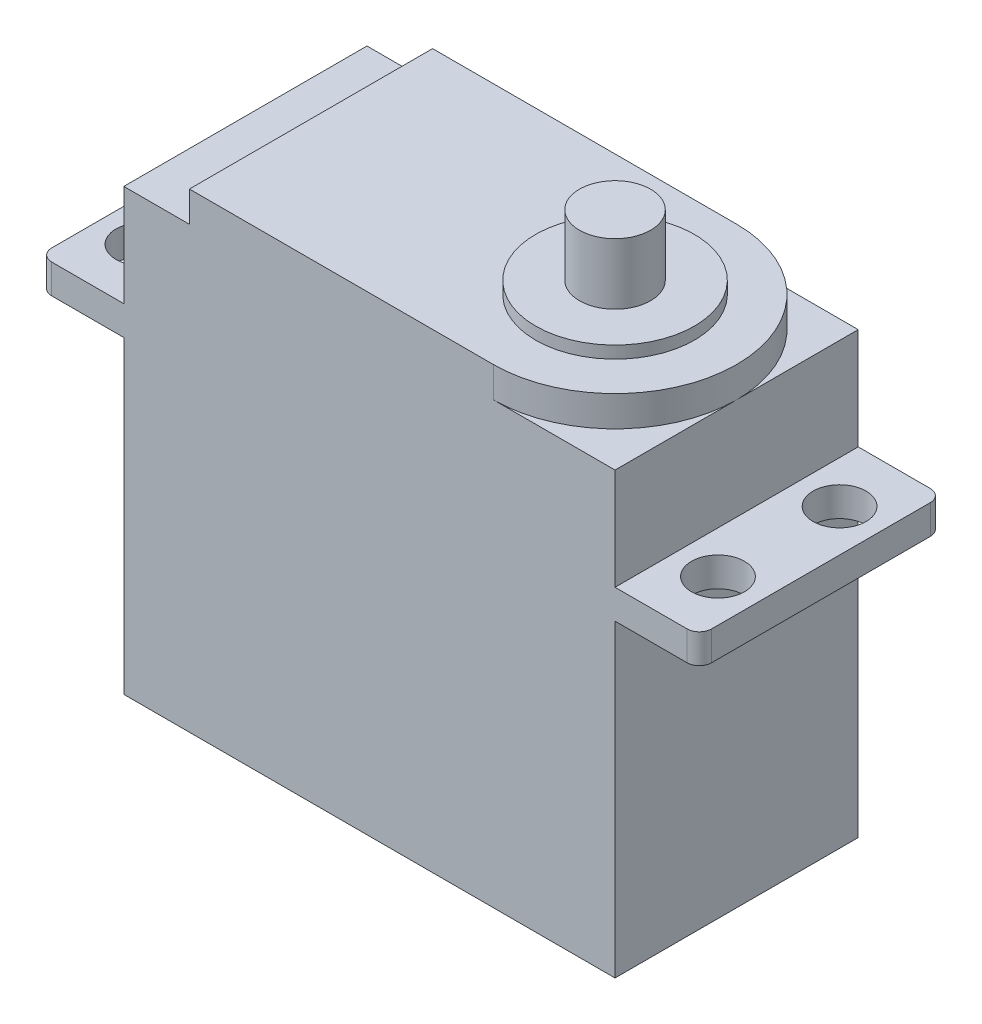
ISO-10303-21;
HEADER;
FILE_DESCRIPTION(('STEP AP214'),'2;1');
FILE_NAME('part.step','',(''),(''),'','','');
FILE_SCHEMA(('AUTOMOTIVE_DESIGN { 1 0 10303 214 1 1 1 1 }'));
ENDSEC;
DATA;
#1=APPLICATION_CONTEXT('core data for automotive mechanical design processes');
#2=APPLICATION_PROTOCOL_DEFINITION('international standard','automotive_design',2000,#1);
#3=PRODUCT_CONTEXT('',#1,'mechanical');
#4=PRODUCT('Part','Part','',(#3));
#5=PRODUCT_RELATED_PRODUCT_CATEGORY('part','',(#4));
#6=PRODUCT_DEFINITION_FORMATION('','',#4);
#7=PRODUCT_DEFINITION_CONTEXT('part definition',#1,'design');
#8=PRODUCT_DEFINITION('design','',#6,#7);
#9=PRODUCT_DEFINITION_SHAPE('','',#8);
#10=(LENGTH_UNIT() NAMED_UNIT(*) SI_UNIT(.MILLI.,.METRE.));
#11=(NAMED_UNIT(*) PLANE_ANGLE_UNIT() SI_UNIT($,.RADIAN.));
#12=(NAMED_UNIT(*) SI_UNIT($,.STERADIAN.) SOLID_ANGLE_UNIT());
#13=UNCERTAINTY_MEASURE_WITH_UNIT(LENGTH_MEASURE(1.E-05),#10,'distance_accuracy_value','');
#14=(GEOMETRIC_REPRESENTATION_CONTEXT(3) GLOBAL_UNCERTAINTY_ASSIGNED_CONTEXT((#13)) GLOBAL_UNIT_ASSIGNED_CONTEXT((#10,
#11,#12)) REPRESENTATION_CONTEXT('',''));
#15=CARTESIAN_POINT('',(0.,0.,0.));
#16=DIRECTION('',(0.,0.,1.));
#17=DIRECTION('',(1.,0.,0.));
#18=AXIS2_PLACEMENT_3D('',#15,#16,#17);
#19=CARTESIAN_POINT('',(0.,36.,0.));
#20=DIRECTION('',(0.,1.,0.));
#21=DIRECTION('',(0.,0.,1.));
#22=AXIS2_PLACEMENT_3D('',#19,#20,#21);
#23=PLANE('',#22);
#24=DIRECTION('',(0.,0.,1.));
#25=VECTOR('',#24,1.);
#26=CARTESIAN_POINT('',(-14.73,36.,0.));
#27=LINE('',#26,#25);
#28=CARTESIAN_POINT('',(-14.73,36.,-9.95));
#29=VERTEX_POINT('',#28);
#30=CARTESIAN_POINT('',(-14.73,36.,9.95));
#31=VERTEX_POINT('',#30);
#32=EDGE_CURVE('E194',#29,#31,#27,.T.);
#33=ORIENTED_EDGE('',*,*,#32,.F.);
#34=DIRECTION('',(-1.,0.,0.));
#35=VECTOR('',#34,1.);
#36=CARTESIAN_POINT('',(-20.1,36.,-9.95));
#37=LINE('',#36,#35);
#38=CARTESIAN_POINT('',(-20.1,36.,-9.95));
#39=VERTEX_POINT('',#38);
#40=EDGE_CURVE('E265',#29,#39,#37,.T.);
#41=ORIENTED_EDGE('',*,*,#40,.T.);
#42=DIRECTION('',(0.,0.,1.));
#43=VECTOR('',#42,1.);
#44=CARTESIAN_POINT('',(-20.1,36.,-9.95));
#45=LINE('',#44,#43);
#46=CARTESIAN_POINT('',(-20.1,36.,9.95));
#47=VERTEX_POINT('',#46);
#48=EDGE_CURVE('E269',#39,#47,#45,.T.);
#49=ORIENTED_EDGE('',*,*,#48,.T.);
#50=DIRECTION('',(1.,0.,0.));
#51=VECTOR('',#50,1.);
#52=CARTESIAN_POINT('',(-20.1,36.,9.95));
#53=LINE('',#52,#51);
#54=EDGE_CURVE('E271',#47,#31,#53,.T.);
#55=ORIENTED_EDGE('',*,*,#54,.T.);
#56=EDGE_LOOP('',(#33,#41,#49,#55));
#57=FACE_BOUND('',#56,.T.);
#58=ADVANCED_FACE('F34',(#57),#23,.T.);
#59=CARTESIAN_POINT('',(10.15,36.,0.));
#60=DIRECTION('',(0.,1.,0.));
#61=DIRECTION('',(0.,0.,1.));
#62=AXIS2_PLACEMENT_3D('',#59,#60,#61);
#63=CIRCLE('',#62,9.95);
#64=CARTESIAN_POINT('',(10.15,36.,9.95));
#65=VERTEX_POINT('',#64);
#66=CARTESIAN_POINT('',(20.1,36.,0.));
#67=VERTEX_POINT('',#66);
#68=EDGE_CURVE('E392',#65,#67,#63,.T.);
#69=ORIENTED_EDGE('',*,*,#68,.F.);
#70=CARTESIAN_POINT('',(20.1,36.,9.95));
#71=VERTEX_POINT('',#70);
#72=EDGE_CURVE('E200',#65,#71,#53,.T.);
#73=ORIENTED_EDGE('',*,*,#72,.T.);
#74=DIRECTION('',(0.,0.,-1.));
#75=VECTOR('',#74,1.);
#76=CARTESIAN_POINT('',(20.1,36.,-9.95));
#77=LINE('',#76,#75);
#78=EDGE_CURVE('E262',#71,#67,#77,.T.);
#79=ORIENTED_EDGE('',*,*,#78,.T.);
#80=EDGE_LOOP('',(#69,#73,#79));
#81=FACE_BOUND('',#80,.T.);
#82=ADVANCED_FACE('F391',(#81),#23,.T.);
#83=CARTESIAN_POINT('',(20.1,36.,-9.95));
#84=DIRECTION('',(-1.,0.,0.));
#85=DIRECTION('',(0.,0.,1.));
#86=AXIS2_PLACEMENT_3D('',#83,#84,#85);
#87=PLANE('',#86);
#88=DIRECTION('',(0.,0.,1.));
#89=VECTOR('',#88,1.);
#90=CARTESIAN_POINT('',(20.1,27.69,-9.95));
#91=LINE('',#90,#89);
#92=CARTESIAN_POINT('',(20.1,27.69,-9.95));
#93=VERTEX_POINT('',#92);
#94=CARTESIAN_POINT('',(20.1,27.69,9.95));
#95=VERTEX_POINT('',#94);
#96=EDGE_CURVE('E258',#93,#95,#91,.T.);
#97=ORIENTED_EDGE('',*,*,#96,.F.);
#98=DIRECTION('',(0.,-1.,0.));
#99=VECTOR('',#98,1.);
#100=CARTESIAN_POINT('',(20.1,36.,-9.95));
#101=LINE('',#100,#99);
#102=CARTESIAN_POINT('',(20.1,36.,-9.95));
#103=VERTEX_POINT('',#102);
#104=EDGE_CURVE('E296',#103,#93,#101,.T.);
#105=ORIENTED_EDGE('',*,*,#104,.F.);
#106=EDGE_CURVE('E266',#67,#103,#77,.T.);
#107=ORIENTED_EDGE('',*,*,#106,.F.);
#108=ORIENTED_EDGE('',*,*,#78,.F.);
#109=DIRECTION('',(0.,-1.,0.));
#110=VECTOR('',#109,1.);
#111=CARTESIAN_POINT('',(20.1,36.,9.95));
#112=LINE('',#111,#110);
#113=EDGE_CURVE('E285',#71,#95,#112,.T.);
#114=ORIENTED_EDGE('',*,*,#113,.T.);
#115=EDGE_LOOP('',(#97,#105,#107,#108,#114));
#116=FACE_BOUND('',#115,.T.);
#117=ADVANCED_FACE('F387',(#116),#87,.F.);
#118=DIRECTION('',(0.,0.,-1.));
#119=VECTOR('',#118,1.);
#120=CARTESIAN_POINT('',(20.1,25.29,-9.95));
#121=LINE('',#120,#119);
#122=CARTESIAN_POINT('',(20.1,25.29,9.95));
#123=VERTEX_POINT('',#122);
#124=CARTESIAN_POINT('',(20.1,25.29,-9.95));
#125=VERTEX_POINT('',#124);
#126=EDGE_CURVE('E252',#123,#125,#121,.T.);
#127=ORIENTED_EDGE('',*,*,#126,.F.);
#128=CARTESIAN_POINT('',(20.1,0.,9.95));
#129=VERTEX_POINT('',#128);
#130=EDGE_CURVE('E273',#123,#129,#112,.T.);
#131=ORIENTED_EDGE('',*,*,#130,.T.);
#132=DIRECTION('',(0.,0.,-1.));
#133=VECTOR('',#132,1.);
#134=CARTESIAN_POINT('',(20.1,0.,-9.95));
#135=LINE('',#134,#133);
#136=CARTESIAN_POINT('',(20.1,0.,-9.95));
#137=VERTEX_POINT('',#136);
#138=EDGE_CURVE('E261',#129,#137,#135,.T.);
#139=ORIENTED_EDGE('',*,*,#138,.T.);
#140=EDGE_CURVE('E295',#125,#137,#101,.T.);
#141=ORIENTED_EDGE('',*,*,#140,.F.);
#142=EDGE_LOOP('',(#127,#131,#139,#141));
#143=FACE_BOUND('',#142,.T.);
#144=ADVANCED_FACE('F367',(#143),#87,.F.);
#145=CARTESIAN_POINT('',(-20.1,36.,-9.95));
#146=DIRECTION('',(1.,0.,0.));
#147=DIRECTION('',(0.,0.,-1.));
#148=AXIS2_PLACEMENT_3D('',#145,#146,#147);
#149=PLANE('',#148);
#150=DIRECTION('',(0.,0.,-1.));
#151=VECTOR('',#150,1.);
#152=CARTESIAN_POINT('',(-20.1,27.69,-9.95));
#153=LINE('',#152,#151);
#154=CARTESIAN_POINT('',(-20.1,27.69,9.95));
#155=VERTEX_POINT('',#154);
#156=CARTESIAN_POINT('',(-20.1,27.69,-9.95));
#157=VERTEX_POINT('',#156);
#158=EDGE_CURVE('E255',#155,#157,#153,.T.);
#159=ORIENTED_EDGE('',*,*,#158,.F.);
#160=DIRECTION('',(0.,-1.,0.));
#161=VECTOR('',#160,1.);
#162=CARTESIAN_POINT('',(-20.1,36.,9.95));
#163=LINE('',#162,#161);
#164=EDGE_CURVE('E289',#47,#155,#163,.T.);
#165=ORIENTED_EDGE('',*,*,#164,.F.);
#166=ORIENTED_EDGE('',*,*,#48,.F.);
#167=DIRECTION('',(0.,-1.,0.));
#168=VECTOR('',#167,1.);
#169=CARTESIAN_POINT('',(-20.1,36.,-9.95));
#170=LINE('',#169,#168);
#171=EDGE_CURVE('E293',#39,#157,#170,.T.);
#172=ORIENTED_EDGE('',*,*,#171,.T.);
#173=EDGE_LOOP('',(#159,#165,#166,#172));
#174=FACE_BOUND('',#173,.T.);
#175=ADVANCED_FACE('F457',(#174),#149,.F.);
#176=DIRECTION('',(0.,0.,1.));
#177=VECTOR('',#176,1.);
#178=CARTESIAN_POINT('',(-20.1,25.29,-9.95));
#179=LINE('',#178,#177);
#180=CARTESIAN_POINT('',(-20.1,25.29,-9.95));
#181=VERTEX_POINT('',#180);
#182=CARTESIAN_POINT('',(-20.1,25.29,9.95));
#183=VERTEX_POINT('',#182);
#184=EDGE_CURVE('E249',#181,#183,#179,.T.);
#185=ORIENTED_EDGE('',*,*,#184,.F.);
#186=CARTESIAN_POINT('',(-20.1,0.,-9.95));
#187=VERTEX_POINT('',#186);
#188=EDGE_CURVE('E292',#181,#187,#170,.T.);
#189=ORIENTED_EDGE('',*,*,#188,.T.);
#190=DIRECTION('',(0.,0.,1.));
#191=VECTOR('',#190,1.);
#192=CARTESIAN_POINT('',(-20.1,0.,-9.95));
#193=LINE('',#192,#191);
#194=CARTESIAN_POINT('',(-20.1,0.,9.95));
#195=VERTEX_POINT('',#194);
#196=EDGE_CURVE('E279',#187,#195,#193,.T.);
#197=ORIENTED_EDGE('',*,*,#196,.T.);
#198=EDGE_CURVE('E288',#183,#195,#163,.T.);
#199=ORIENTED_EDGE('',*,*,#198,.F.);
#200=EDGE_LOOP('',(#185,#189,#197,#199));
#201=FACE_BOUND('',#200,.T.);
#202=ADVANCED_FACE('F351',(#201),#149,.F.);
#203=CARTESIAN_POINT('',(-20.1,36.,-9.95));
#204=DIRECTION('',(0.,0.,1.));
#205=DIRECTION('',(1.,0.,0.));
#206=AXIS2_PLACEMENT_3D('',#203,#204,#205);
#207=PLANE('',#206);
#208=DIRECTION('',(-1.,0.,0.));
#209=VECTOR('',#208,1.);
#210=CARTESIAN_POINT('',(27.,27.69,-9.95));
#211=LINE('',#210,#209);
#212=CARTESIAN_POINT('',(26.,27.69,-9.95));
#213=VERTEX_POINT('',#212);
#214=EDGE_CURVE('E247',#213,#93,#211,.T.);
#215=ORIENTED_EDGE('',*,*,#214,.F.);
#216=DIRECTION('',(0.,1.,0.));
#217=VECTOR('',#216,1.);
#218=CARTESIAN_POINT('',(26.,36.,-9.95));
#219=LINE('',#218,#217);
#220=CARTESIAN_POINT('',(26.,25.29,-9.95));
#221=VERTEX_POINT('',#220);
#222=EDGE_CURVE('E327',#213,#221,#219,.F.);
#223=ORIENTED_EDGE('',*,*,#222,.T.);
#224=DIRECTION('',(-1.,0.,0.));
#225=VECTOR('',#224,1.);
#226=CARTESIAN_POINT('',(27.,25.29,-9.95));
#227=LINE('',#226,#225);
#228=EDGE_CURVE('E238',#221,#125,#227,.T.);
#229=ORIENTED_EDGE('',*,*,#228,.T.);
#230=ORIENTED_EDGE('',*,*,#140,.T.);
#231=DIRECTION('',(-1.,0.,0.));
#232=VECTOR('',#231,1.);
#233=CARTESIAN_POINT('',(-20.1,0.,-9.95));
#234=LINE('',#233,#232);
#235=EDGE_CURVE('E276',#137,#187,#234,.T.);
#236=ORIENTED_EDGE('',*,*,#235,.T.);
#237=ORIENTED_EDGE('',*,*,#188,.F.);
#238=CARTESIAN_POINT('',(-26.,25.29,-9.95));
#239=VERTEX_POINT('',#238);
#240=EDGE_CURVE('E234',#181,#239,#227,.T.);
#241=ORIENTED_EDGE('',*,*,#240,.T.);
#242=DIRECTION('',(0.,1.,0.));
#243=VECTOR('',#242,1.);
#244=CARTESIAN_POINT('',(-26.,27.69,-9.95));
#245=LINE('',#244,#243);
#246=CARTESIAN_POINT('',(-26.,27.69,-9.95));
#247=VERTEX_POINT('',#246);
#248=EDGE_CURVE('E324',#239,#247,#245,.T.);
#249=ORIENTED_EDGE('',*,*,#248,.T.);
#250=EDGE_CURVE('E246',#157,#247,#211,.T.);
#251=ORIENTED_EDGE('',*,*,#250,.F.);
#252=ORIENTED_EDGE('',*,*,#171,.F.);
#253=ORIENTED_EDGE('',*,*,#40,.F.);
#254=DIRECTION('',(0.,-1.,0.));
#255=VECTOR('',#254,1.);
#256=CARTESIAN_POINT('',(-14.73,38.5,-9.95));
#257=LINE('',#256,#255);
#258=CARTESIAN_POINT('',(-14.73,38.5,-9.95));
#259=VERTEX_POINT('',#258);
#260=EDGE_CURVE('E206',#259,#29,#257,.T.);
#261=ORIENTED_EDGE('',*,*,#260,.F.);
#262=DIRECTION('',(-1.,0.,0.));
#263=VECTOR('',#262,1.);
#264=CARTESIAN_POINT('',(0.,38.5,-9.95));
#265=LINE('',#264,#263);
#266=CARTESIAN_POINT('',(10.15,38.5,-9.95));
#267=VERTEX_POINT('',#266);
#268=EDGE_CURVE('E184',#267,#259,#265,.T.);
#269=ORIENTED_EDGE('',*,*,#268,.F.);
#270=DIRECTION('',(0.,-1.,0.));
#271=VECTOR('',#270,1.);
#272=CARTESIAN_POINT('',(10.15,38.5,-9.95));
#273=LINE('',#272,#271);
#274=CARTESIAN_POINT('',(10.15,36.,-9.95));
#275=VERTEX_POINT('',#274);
#276=EDGE_CURVE('E181',#267,#275,#273,.T.);
#277=ORIENTED_EDGE('',*,*,#276,.T.);
#278=EDGE_CURVE('E267',#103,#275,#37,.T.);
#279=ORIENTED_EDGE('',*,*,#278,.F.);
#280=ORIENTED_EDGE('',*,*,#104,.T.);
#281=EDGE_LOOP('',(#215,#223,#229,#230,#236,#237,#241,#249,#251,#252,#253,#261,#269,#277,#279,#280));
#282=FACE_BOUND('',#281,.T.);
#283=ADVANCED_FACE('F354',(#282),#207,.F.);
#284=CARTESIAN_POINT('',(-20.1,36.,9.95));
#285=DIRECTION('',(0.,0.,-1.));
#286=DIRECTION('',(-1.,0.,0.));
#287=AXIS2_PLACEMENT_3D('',#284,#285,#286);
#288=PLANE('',#287);
#289=DIRECTION('',(-1.,0.,0.));
#290=VECTOR('',#289,1.);
#291=CARTESIAN_POINT('',(27.,25.29,9.95));
#292=LINE('',#291,#290);
#293=CARTESIAN_POINT('',(26.,25.29,9.95));
#294=VERTEX_POINT('',#293);
#295=EDGE_CURVE('E241',#294,#123,#292,.T.);
#296=ORIENTED_EDGE('',*,*,#295,.F.);
#297=DIRECTION('',(0.,-1.,0.));
#298=VECTOR('',#297,1.);
#299=CARTESIAN_POINT('',(26.,36.,9.95));
#300=LINE('',#299,#298);
#301=CARTESIAN_POINT('',(26.,27.69,9.95));
#302=VERTEX_POINT('',#301);
#303=EDGE_CURVE('E318',#294,#302,#300,.F.);
#304=ORIENTED_EDGE('',*,*,#303,.T.);
#305=DIRECTION('',(-1.,0.,0.));
#306=VECTOR('',#305,1.);
#307=CARTESIAN_POINT('',(27.,27.69,9.95));
#308=LINE('',#307,#306);
#309=EDGE_CURVE('E244',#302,#95,#308,.T.);
#310=ORIENTED_EDGE('',*,*,#309,.T.);
#311=ORIENTED_EDGE('',*,*,#113,.F.);
#312=ORIENTED_EDGE('',*,*,#72,.F.);
#313=DIRECTION('',(0.,-1.,0.));
#314=VECTOR('',#313,1.);
#315=CARTESIAN_POINT('',(10.15,38.5,9.95));
#316=LINE('',#315,#314);
#317=CARTESIAN_POINT('',(10.15,38.5,9.95));
#318=VERTEX_POINT('',#317);
#319=EDGE_CURVE('E178',#318,#65,#316,.T.);
#320=ORIENTED_EDGE('',*,*,#319,.F.);
#321=DIRECTION('',(1.,0.,0.));
#322=VECTOR('',#321,1.);
#323=CARTESIAN_POINT('',(0.,38.5,9.95));
#324=LINE('',#323,#322);
#325=CARTESIAN_POINT('',(-14.73,38.5,9.95));
#326=VERTEX_POINT('',#325);
#327=EDGE_CURVE('E185',#326,#318,#324,.T.);
#328=ORIENTED_EDGE('',*,*,#327,.F.);
#329=DIRECTION('',(0.,-1.,0.));
#330=VECTOR('',#329,1.);
#331=CARTESIAN_POINT('',(-14.73,38.5,9.95));
#332=LINE('',#331,#330);
#333=EDGE_CURVE('E410',#326,#31,#332,.T.);
#334=ORIENTED_EDGE('',*,*,#333,.T.);
#335=ORIENTED_EDGE('',*,*,#54,.F.);
#336=ORIENTED_EDGE('',*,*,#164,.T.);
#337=CARTESIAN_POINT('',(-26.,27.69,9.95));
#338=VERTEX_POINT('',#337);
#339=EDGE_CURVE('E243',#155,#338,#308,.T.);
#340=ORIENTED_EDGE('',*,*,#339,.T.);
#341=DIRECTION('',(0.,-1.,0.));
#342=VECTOR('',#341,1.);
#343=CARTESIAN_POINT('',(-26.,25.29,9.95));
#344=LINE('',#343,#342);
#345=CARTESIAN_POINT('',(-26.,25.29,9.95));
#346=VERTEX_POINT('',#345);
#347=EDGE_CURVE('E315',#338,#346,#344,.T.);
#348=ORIENTED_EDGE('',*,*,#347,.T.);
#349=EDGE_CURVE('E240',#183,#346,#292,.T.);
#350=ORIENTED_EDGE('',*,*,#349,.F.);
#351=ORIENTED_EDGE('',*,*,#198,.T.);
#352=DIRECTION('',(1.,0.,0.));
#353=VECTOR('',#352,1.);
#354=CARTESIAN_POINT('',(-20.1,0.,9.95));
#355=LINE('',#354,#353);
#356=EDGE_CURVE('E282',#195,#129,#355,.T.);
#357=ORIENTED_EDGE('',*,*,#356,.T.);
#358=ORIENTED_EDGE('',*,*,#130,.F.);
#359=EDGE_LOOP('',(#296,#304,#310,#311,#312,#320,#328,#334,#335,#336,#340,#348,#350,#351,#357,#358));
#360=FACE_BOUND('',#359,.T.);
#361=ADVANCED_FACE('F198',(#360),#288,.F.);
#362=EDGE_CURVE('E299',#67,#275,#63,.T.);
#363=ORIENTED_EDGE('',*,*,#362,.F.);
#364=ORIENTED_EDGE('',*,*,#106,.T.);
#365=ORIENTED_EDGE('',*,*,#278,.T.);
#366=EDGE_LOOP('',(#363,#364,#365));
#367=FACE_BOUND('',#366,.T.);
#368=ADVANCED_FACE('F437',(#367),#23,.T.);
#369=CARTESIAN_POINT('',(0.,0.,0.));
#370=DIRECTION('',(0.,1.,0.));
#371=DIRECTION('',(0.,0.,1.));
#372=AXIS2_PLACEMENT_3D('',#369,#370,#371);
#373=PLANE('',#372);
#374=ORIENTED_EDGE('',*,*,#138,.F.);
#375=ORIENTED_EDGE('',*,*,#356,.F.);
#376=ORIENTED_EDGE('',*,*,#196,.F.);
#377=ORIENTED_EDGE('',*,*,#235,.F.);
#378=EDGE_LOOP('',(#374,#375,#376,#377));
#379=FACE_BOUND('',#378,.T.);
#380=ADVANCED_FACE('F362',(#379),#373,.F.);
#381=CARTESIAN_POINT('',(-27.,0.,0.));
#382=DIRECTION('',(-1.,0.,0.));
#383=DIRECTION('',(0.,0.,1.));
#384=AXIS2_PLACEMENT_3D('',#381,#382,#383);
#385=PLANE('',#384);
#386=DIRECTION('',(0.,0.,1.));
#387=VECTOR('',#386,1.);
#388=CARTESIAN_POINT('',(-27.,27.69,9.95));
#389=LINE('',#388,#387);
#390=CARTESIAN_POINT('',(-27.,27.69,-8.95));
#391=VERTEX_POINT('',#390);
#392=CARTESIAN_POINT('',(-27.,27.69,8.95));
#393=VERTEX_POINT('',#392);
#394=EDGE_CURVE('E226',#391,#393,#389,.T.);
#395=ORIENTED_EDGE('',*,*,#394,.F.);
#396=DIRECTION('',(0.,1.,0.));
#397=VECTOR('',#396,1.);
#398=CARTESIAN_POINT('',(-27.,25.29,-8.95));
#399=LINE('',#398,#397);
#400=CARTESIAN_POINT('',(-27.,25.29,-8.95));
#401=VERTEX_POINT('',#400);
#402=EDGE_CURVE('E49',#391,#401,#399,.F.);
#403=ORIENTED_EDGE('',*,*,#402,.T.);
#404=DIRECTION('',(0.,0.,-1.));
#405=VECTOR('',#404,1.);
#406=CARTESIAN_POINT('',(-27.,25.29,-9.95));
#407=LINE('',#406,#405);
#408=CARTESIAN_POINT('',(-27.,25.29,8.95));
#409=VERTEX_POINT('',#408);
#410=EDGE_CURVE('E231',#409,#401,#407,.T.);
#411=ORIENTED_EDGE('',*,*,#410,.F.);
#412=DIRECTION('',(0.,-1.,0.));
#413=VECTOR('',#412,1.);
#414=CARTESIAN_POINT('',(-27.,27.69,8.95));
#415=LINE('',#414,#413);
#416=EDGE_CURVE('E333',#409,#393,#415,.F.);
#417=ORIENTED_EDGE('',*,*,#416,.T.);
#418=EDGE_LOOP('',(#395,#403,#411,#417));
#419=FACE_BOUND('',#418,.T.);
#420=ADVANCED_FACE('F336',(#419),#385,.T.);
#421=CARTESIAN_POINT('',(27.,25.29,-9.95));
#422=DIRECTION('',(0.,1.,0.));
#423=DIRECTION('',(0.,0.,1.));
#424=AXIS2_PLACEMENT_3D('',#421,#422,#423);
#425=PLANE('',#424);
#426=CARTESIAN_POINT('',(-23.55,25.29,4.975));
#427=DIRECTION('',(0.,1.,0.));
#428=DIRECTION('',(0.,0.,1.));
#429=AXIS2_PLACEMENT_3D('',#426,#427,#428);
#430=CIRCLE('',#429,2.165);
#431=CARTESIAN_POINT('',(-23.55,25.29,7.14));
#432=VERTEX_POINT('',#431);
#433=EDGE_CURVE('E222',#432,#432,#430,.T.);
#434=ORIENTED_EDGE('',*,*,#433,.T.);
#435=EDGE_LOOP('',(#434));
#436=FACE_BOUND('',#435,.T.);
#437=CARTESIAN_POINT('',(-23.55,25.29,-4.97499999999999));
#438=DIRECTION('',(0.,1.,0.));
#439=DIRECTION('',(0.,0.,1.));
#440=AXIS2_PLACEMENT_3D('',#437,#438,#439);
#441=CIRCLE('',#440,2.165);
#442=CARTESIAN_POINT('',(-23.55,25.29,-2.80999999999999));
#443=VERTEX_POINT('',#442);
#444=EDGE_CURVE('E219',#443,#443,#441,.T.);
#445=ORIENTED_EDGE('',*,*,#444,.T.);
#446=EDGE_LOOP('',(#445));
#447=FACE_BOUND('',#446,.T.);
#448=ORIENTED_EDGE('',*,*,#410,.T.);
#449=CARTESIAN_POINT('',(-26.,25.29,-8.95));
#450=DIRECTION('',(0.,1.,0.));
#451=DIRECTION('',(0.,0.,1.));
#452=AXIS2_PLACEMENT_3D('',#449,#450,#451);
#453=CIRCLE('',#452,1.);
#454=EDGE_CURVE('E11',#401,#239,#453,.F.);
#455=ORIENTED_EDGE('',*,*,#454,.T.);
#456=ORIENTED_EDGE('',*,*,#240,.F.);
#457=ORIENTED_EDGE('',*,*,#184,.T.);
#458=ORIENTED_EDGE('',*,*,#349,.T.);
#459=CARTESIAN_POINT('',(-26.,25.29,8.95));
#460=DIRECTION('',(0.,1.,0.));
#461=DIRECTION('',(0.,0.,1.));
#462=AXIS2_PLACEMENT_3D('',#459,#460,#461);
#463=CIRCLE('',#462,1.);
#464=EDGE_CURVE('E42',#346,#409,#463,.F.);
#465=ORIENTED_EDGE('',*,*,#464,.T.);
#466=EDGE_LOOP('',(#448,#455,#456,#457,#458,#465));
#467=FACE_BOUND('',#466,.T.);
#468=ADVANCED_FACE('F346',(#436,#447,#467),#425,.F.);
#469=CARTESIAN_POINT('',(27.,27.69,9.95));
#470=DIRECTION('',(0.,-1.,0.));
#471=DIRECTION('',(0.,0.,-1.));
#472=AXIS2_PLACEMENT_3D('',#469,#470,#471);
#473=PLANE('',#472);
#474=CARTESIAN_POINT('',(-23.55,27.69,4.975));
#475=DIRECTION('',(0.,1.,0.));
#476=DIRECTION('',(0.,0.,1.));
#477=AXIS2_PLACEMENT_3D('',#474,#475,#476);
#478=CIRCLE('',#477,2.165);
#479=CARTESIAN_POINT('',(-23.55,27.69,7.14));
#480=VERTEX_POINT('',#479);
#481=EDGE_CURVE('E210',#480,#480,#478,.T.);
#482=ORIENTED_EDGE('',*,*,#481,.F.);
#483=EDGE_LOOP('',(#482));
#484=FACE_BOUND('',#483,.T.);
#485=CARTESIAN_POINT('',(-23.55,27.69,-4.97499999999999));
#486=DIRECTION('',(0.,1.,0.));
#487=DIRECTION('',(0.,0.,1.));
#488=AXIS2_PLACEMENT_3D('',#485,#486,#487);
#489=CIRCLE('',#488,2.165);
#490=CARTESIAN_POINT('',(-23.55,27.69,-2.80999999999999));
#491=VERTEX_POINT('',#490);
#492=EDGE_CURVE('E213',#491,#491,#489,.T.);
#493=ORIENTED_EDGE('',*,*,#492,.F.);
#494=EDGE_LOOP('',(#493));
#495=FACE_BOUND('',#494,.T.);
#496=ORIENTED_EDGE('',*,*,#250,.T.);
#497=CARTESIAN_POINT('',(-26.,27.69,-8.95));
#498=DIRECTION('',(0.,-1.,0.));
#499=DIRECTION('',(0.,0.,-1.));
#500=AXIS2_PLACEMENT_3D('',#497,#498,#499);
#501=CIRCLE('',#500,1.);
#502=EDGE_CURVE('E331',#247,#391,#501,.F.);
#503=ORIENTED_EDGE('',*,*,#502,.T.);
#504=ORIENTED_EDGE('',*,*,#394,.T.);
#505=CARTESIAN_POINT('',(-26.,27.69,8.95));
#506=DIRECTION('',(0.,-1.,0.));
#507=DIRECTION('',(0.,0.,-1.));
#508=AXIS2_PLACEMENT_3D('',#505,#506,#507);
#509=CIRCLE('',#508,1.);
#510=EDGE_CURVE('E329',#393,#338,#509,.F.);
#511=ORIENTED_EDGE('',*,*,#510,.T.);
#512=ORIENTED_EDGE('',*,*,#339,.F.);
#513=ORIENTED_EDGE('',*,*,#158,.T.);
#514=EDGE_LOOP('',(#496,#503,#504,#511,#512,#513));
#515=FACE_BOUND('',#514,.T.);
#516=ADVANCED_FACE('F341',(#484,#495,#515),#473,.F.);
#517=CARTESIAN_POINT('',(23.55,27.69,-4.97499999999999));
#518=DIRECTION('',(0.,1.,0.));
#519=DIRECTION('',(0.,0.,1.));
#520=AXIS2_PLACEMENT_3D('',#517,#518,#519);
#521=CIRCLE('',#520,2.165);
#522=CARTESIAN_POINT('',(23.55,27.69,-2.80999999999999));
#523=VERTEX_POINT('',#522);
#524=EDGE_CURVE('E204',#523,#523,#521,.T.);
#525=ORIENTED_EDGE('',*,*,#524,.F.);
#526=EDGE_LOOP('',(#525));
#527=FACE_BOUND('',#526,.T.);
#528=CARTESIAN_POINT('',(23.55,27.69,4.975));
#529=DIRECTION('',(0.,1.,0.));
#530=DIRECTION('',(0.,0.,1.));
#531=AXIS2_PLACEMENT_3D('',#528,#529,#530);
#532=CIRCLE('',#531,2.165);
#533=CARTESIAN_POINT('',(23.55,27.69,7.14));
#534=VERTEX_POINT('',#533);
#535=EDGE_CURVE('E201',#534,#534,#532,.T.);
#536=ORIENTED_EDGE('',*,*,#535,.F.);
#537=EDGE_LOOP('',(#536));
#538=FACE_BOUND('',#537,.T.);
#539=ORIENTED_EDGE('',*,*,#309,.F.);
#540=CARTESIAN_POINT('',(26.,27.69,8.95));
#541=DIRECTION('',(0.,-1.,0.));
#542=DIRECTION('',(0.,0.,-1.));
#543=AXIS2_PLACEMENT_3D('',#540,#541,#542);
#544=CIRCLE('',#543,1.);
#545=CARTESIAN_POINT('',(27.,27.69,8.95));
#546=VERTEX_POINT('',#545);
#547=EDGE_CURVE('E322',#302,#546,#544,.F.);
#548=ORIENTED_EDGE('',*,*,#547,.T.);
#549=DIRECTION('',(0.,0.,1.));
#550=VECTOR('',#549,1.);
#551=CARTESIAN_POINT('',(27.,27.69,9.95));
#552=LINE('',#551,#550);
#553=CARTESIAN_POINT('',(27.,27.69,-8.95));
#554=VERTEX_POINT('',#553);
#555=EDGE_CURVE('E227',#554,#546,#552,.T.);
#556=ORIENTED_EDGE('',*,*,#555,.F.);
#557=CARTESIAN_POINT('',(26.,27.69,-8.95));
#558=DIRECTION('',(0.,-1.,0.));
#559=DIRECTION('',(0.,0.,-1.));
#560=AXIS2_PLACEMENT_3D('',#557,#558,#559);
#561=CIRCLE('',#560,1.);
#562=EDGE_CURVE('E320',#554,#213,#561,.F.);
#563=ORIENTED_EDGE('',*,*,#562,.T.);
#564=ORIENTED_EDGE('',*,*,#214,.T.);
#565=ORIENTED_EDGE('',*,*,#96,.T.);
#566=EDGE_LOOP('',(#539,#548,#556,#563,#564,#565));
#567=FACE_BOUND('',#566,.T.);
#568=ADVANCED_FACE('F383',(#527,#538,#567),#473,.F.);
#569=CARTESIAN_POINT('',(23.55,25.29,-4.97499999999999));
#570=DIRECTION('',(0.,1.,0.));
#571=DIRECTION('',(0.,0.,1.));
#572=AXIS2_PLACEMENT_3D('',#569,#570,#571);
#573=CIRCLE('',#572,2.165);
#574=CARTESIAN_POINT('',(23.55,25.29,-2.80999999999999));
#575=VERTEX_POINT('',#574);
#576=EDGE_CURVE('E223',#575,#575,#573,.T.);
#577=ORIENTED_EDGE('',*,*,#576,.T.);
#578=EDGE_LOOP('',(#577));
#579=FACE_BOUND('',#578,.T.);
#580=CARTESIAN_POINT('',(23.55,25.29,4.975));
#581=DIRECTION('',(0.,1.,0.));
#582=DIRECTION('',(0.,0.,1.));
#583=AXIS2_PLACEMENT_3D('',#580,#581,#582);
#584=CIRCLE('',#583,2.165);
#585=CARTESIAN_POINT('',(23.55,25.29,7.14));
#586=VERTEX_POINT('',#585);
#587=EDGE_CURVE('E218',#586,#586,#584,.T.);
#588=ORIENTED_EDGE('',*,*,#587,.T.);
#589=EDGE_LOOP('',(#588));
#590=FACE_BOUND('',#589,.T.);
#591=DIRECTION('',(0.,0.,-1.));
#592=VECTOR('',#591,1.);
#593=CARTESIAN_POINT('',(27.,25.29,-9.95));
#594=LINE('',#593,#592);
#595=CARTESIAN_POINT('',(27.,25.29,8.95));
#596=VERTEX_POINT('',#595);
#597=CARTESIAN_POINT('',(27.,25.29,-8.95));
#598=VERTEX_POINT('',#597);
#599=EDGE_CURVE('E230',#596,#598,#594,.T.);
#600=ORIENTED_EDGE('',*,*,#599,.F.);
#601=CARTESIAN_POINT('',(26.,25.29,8.95));
#602=DIRECTION('',(0.,1.,0.));
#603=DIRECTION('',(0.,0.,1.));
#604=AXIS2_PLACEMENT_3D('',#601,#602,#603);
#605=CIRCLE('',#604,1.);
#606=EDGE_CURVE('E313',#596,#294,#605,.F.);
#607=ORIENTED_EDGE('',*,*,#606,.T.);
#608=ORIENTED_EDGE('',*,*,#295,.T.);
#609=ORIENTED_EDGE('',*,*,#126,.T.);
#610=ORIENTED_EDGE('',*,*,#228,.F.);
#611=CARTESIAN_POINT('',(26.,25.29,-8.95));
#612=DIRECTION('',(0.,1.,0.));
#613=DIRECTION('',(0.,0.,1.));
#614=AXIS2_PLACEMENT_3D('',#611,#612,#613);
#615=CIRCLE('',#614,1.);
#616=EDGE_CURVE('E311',#221,#598,#615,.F.);
#617=ORIENTED_EDGE('',*,*,#616,.T.);
#618=EDGE_LOOP('',(#600,#607,#608,#609,#610,#617));
#619=FACE_BOUND('',#618,.T.);
#620=ADVANCED_FACE('F371',(#579,#590,#619),#425,.F.);
#621=CARTESIAN_POINT('',(27.,0.,0.));
#622=DIRECTION('',(-1.,0.,0.));
#623=DIRECTION('',(0.,0.,1.));
#624=AXIS2_PLACEMENT_3D('',#621,#622,#623);
#625=PLANE('',#624);
#626=ORIENTED_EDGE('',*,*,#555,.T.);
#627=DIRECTION('',(0.,-1.,0.));
#628=VECTOR('',#627,1.);
#629=CARTESIAN_POINT('',(27.,0.,8.95));
#630=LINE('',#629,#628);
#631=EDGE_CURVE('E307',#546,#596,#630,.T.);
#632=ORIENTED_EDGE('',*,*,#631,.T.);
#633=ORIENTED_EDGE('',*,*,#599,.T.);
#634=DIRECTION('',(0.,1.,0.));
#635=VECTOR('',#634,1.);
#636=CARTESIAN_POINT('',(27.,0.,-8.95));
#637=LINE('',#636,#635);
#638=EDGE_CURVE('E304',#598,#554,#637,.T.);
#639=ORIENTED_EDGE('',*,*,#638,.T.);
#640=EDGE_LOOP('',(#626,#632,#633,#639));
#641=FACE_BOUND('',#640,.T.);
#642=ADVANCED_FACE('F378',(#641),#625,.F.);
#643=CARTESIAN_POINT('',(23.55,-29.62,4.975));
#644=DIRECTION('',(0.,1.,0.));
#645=DIRECTION('',(0.,0.,1.));
#646=AXIS2_PLACEMENT_3D('',#643,#644,#645);
#647=CYLINDRICAL_SURFACE('',#646,2.165);
#648=ORIENTED_EDGE('',*,*,#535,.T.);
#649=EDGE_LOOP('',(#648));
#650=FACE_BOUND('',#649,.T.);
#651=ORIENTED_EDGE('',*,*,#587,.F.);
#652=EDGE_LOOP('',(#651));
#653=FACE_BOUND('',#652,.T.);
#654=ADVANCED_FACE('F493',(#650,#653),#647,.F.);
#655=CARTESIAN_POINT('',(23.55,-29.62,-4.97499999999999));
#656=DIRECTION('',(0.,1.,0.));
#657=DIRECTION('',(0.,0.,1.));
#658=AXIS2_PLACEMENT_3D('',#655,#656,#657);
#659=CYLINDRICAL_SURFACE('',#658,2.165);
#660=ORIENTED_EDGE('',*,*,#524,.T.);
#661=EDGE_LOOP('',(#660));
#662=FACE_BOUND('',#661,.T.);
#663=ORIENTED_EDGE('',*,*,#576,.F.);
#664=EDGE_LOOP('',(#663));
#665=FACE_BOUND('',#664,.T.);
#666=ADVANCED_FACE('F496',(#662,#665),#659,.F.);
#667=CARTESIAN_POINT('',(-23.55,-29.62,-4.97499999999999));
#668=DIRECTION('',(0.,1.,0.));
#669=DIRECTION('',(0.,0.,1.));
#670=AXIS2_PLACEMENT_3D('',#667,#668,#669);
#671=CYLINDRICAL_SURFACE('',#670,2.165);
#672=ORIENTED_EDGE('',*,*,#492,.T.);
#673=EDGE_LOOP('',(#672));
#674=FACE_BOUND('',#673,.T.);
#675=ORIENTED_EDGE('',*,*,#444,.F.);
#676=EDGE_LOOP('',(#675));
#677=FACE_BOUND('',#676,.T.);
#678=ADVANCED_FACE('F500',(#674,#677),#671,.F.);
#679=CARTESIAN_POINT('',(-23.55,-29.62,4.975));
#680=DIRECTION('',(0.,1.,0.));
#681=DIRECTION('',(0.,0.,1.));
#682=AXIS2_PLACEMENT_3D('',#679,#680,#681);
#683=CYLINDRICAL_SURFACE('',#682,2.165);
#684=ORIENTED_EDGE('',*,*,#481,.T.);
#685=EDGE_LOOP('',(#684));
#686=FACE_BOUND('',#685,.T.);
#687=ORIENTED_EDGE('',*,*,#433,.F.);
#688=EDGE_LOOP('',(#687));
#689=FACE_BOUND('',#688,.T.);
#690=ADVANCED_FACE('F492',(#686,#689),#683,.F.);
#691=CARTESIAN_POINT('',(10.15,38.5,0.));
#692=DIRECTION('',(0.,-1.,0.));
#693=DIRECTION('',(0.,0.,-1.));
#694=AXIS2_PLACEMENT_3D('',#691,#692,#693);
#695=CYLINDRICAL_SURFACE('',#694,9.95);
#696=ORIENTED_EDGE('',*,*,#68,.T.);
#697=ORIENTED_EDGE('',*,*,#362,.T.);
#698=ORIENTED_EDGE('',*,*,#276,.F.);
#699=CARTESIAN_POINT('',(10.15,38.5,0.));
#700=DIRECTION('',(0.,1.,0.));
#701=DIRECTION('',(0.,0.,1.));
#702=AXIS2_PLACEMENT_3D('',#699,#700,#701);
#703=CIRCLE('',#702,9.95);
#704=EDGE_CURVE('E173',#318,#267,#703,.T.);
#705=ORIENTED_EDGE('',*,*,#704,.F.);
#706=ORIENTED_EDGE('',*,*,#319,.T.);
#707=EDGE_LOOP('',(#696,#697,#698,#705,#706));
#708=FACE_BOUND('',#707,.T.);
#709=ADVANCED_FACE('F176',(#708),#695,.T.);
#710=CARTESIAN_POINT('',(-14.73,38.5,0.));
#711=DIRECTION('',(1.,0.,0.));
#712=DIRECTION('',(0.,0.,-1.));
#713=AXIS2_PLACEMENT_3D('',#710,#711,#712);
#714=PLANE('',#713);
#715=ORIENTED_EDGE('',*,*,#32,.T.);
#716=ORIENTED_EDGE('',*,*,#333,.F.);
#717=DIRECTION('',(0.,0.,1.));
#718=VECTOR('',#717,1.);
#719=CARTESIAN_POINT('',(-14.73,38.5,0.));
#720=LINE('',#719,#718);
#721=EDGE_CURVE('E190',#259,#326,#720,.T.);
#722=ORIENTED_EDGE('',*,*,#721,.F.);
#723=ORIENTED_EDGE('',*,*,#260,.T.);
#724=EDGE_LOOP('',(#715,#716,#722,#723));
#725=FACE_BOUND('',#724,.T.);
#726=ADVANCED_FACE('F416',(#725),#714,.F.);
#727=CARTESIAN_POINT('',(0.,38.5,0.));
#728=DIRECTION('',(0.,1.,0.));
#729=DIRECTION('',(0.,0.,1.));
#730=AXIS2_PLACEMENT_3D('',#727,#728,#729);
#731=PLANE('',#730);
#732=CARTESIAN_POINT('',(10.15,38.5,0.));
#733=DIRECTION('',(0.,1.,0.));
#734=DIRECTION('',(0.,0.,1.));
#735=AXIS2_PLACEMENT_3D('',#732,#733,#734);
#736=CIRCLE('',#735,6.5);
#737=CARTESIAN_POINT('',(10.15,38.5,6.5));
#738=VERTEX_POINT('',#737);
#739=EDGE_CURVE('E398',#738,#738,#736,.T.);
#740=ORIENTED_EDGE('',*,*,#739,.F.);
#741=EDGE_LOOP('',(#740));
#742=FACE_BOUND('',#741,.T.);
#743=ORIENTED_EDGE('',*,*,#327,.T.);
#744=ORIENTED_EDGE('',*,*,#704,.T.);
#745=ORIENTED_EDGE('',*,*,#268,.T.);
#746=ORIENTED_EDGE('',*,*,#721,.T.);
#747=EDGE_LOOP('',(#743,#744,#745,#746));
#748=FACE_BOUND('',#747,.T.);
#749=ADVANCED_FACE('F188',(#742,#748),#731,.T.);
#750=CARTESIAN_POINT('',(10.15,39.5,0.));
#751=DIRECTION('',(0.,-1.,0.));
#752=DIRECTION('',(0.,0.,-1.));
#753=AXIS2_PLACEMENT_3D('',#750,#751,#752);
#754=CYLINDRICAL_SURFACE('',#753,6.5);
#755=CARTESIAN_POINT('',(10.15,39.5,0.));
#756=DIRECTION('',(0.,1.,0.));
#757=DIRECTION('',(0.,0.,1.));
#758=AXIS2_PLACEMENT_3D('',#755,#756,#757);
#759=CIRCLE('',#758,6.5);
#760=CARTESIAN_POINT('',(10.15,39.5,6.5));
#761=VERTEX_POINT('',#760);
#762=EDGE_CURVE('E393',#761,#761,#759,.T.);
#763=ORIENTED_EDGE('',*,*,#762,.F.);
#764=EDGE_LOOP('',(#763));
#765=FACE_BOUND('',#764,.T.);
#766=ORIENTED_EDGE('',*,*,#739,.T.);
#767=EDGE_LOOP('',(#766));
#768=FACE_BOUND('',#767,.T.);
#769=ADVANCED_FACE('F480',(#765,#768),#754,.T.);
#770=CARTESIAN_POINT('',(0.,39.5,0.));
#771=DIRECTION('',(0.,1.,0.));
#772=DIRECTION('',(0.,0.,1.));
#773=AXIS2_PLACEMENT_3D('',#770,#771,#772);
#774=PLANE('',#773);
#775=CARTESIAN_POINT('',(10.15,39.5,0.));
#776=DIRECTION('',(0.,1.,0.));
#777=DIRECTION('',(0.,0.,1.));
#778=AXIS2_PLACEMENT_3D('',#775,#776,#777);
#779=CIRCLE('',#778,2.91);
#780=CARTESIAN_POINT('',(10.15,39.5,2.91));
#781=VERTEX_POINT('',#780);
#782=EDGE_CURVE('E308',#781,#781,#779,.T.);
#783=ORIENTED_EDGE('',*,*,#782,.F.);
#784=EDGE_LOOP('',(#783));
#785=FACE_BOUND('',#784,.T.);
#786=ORIENTED_EDGE('',*,*,#762,.T.);
#787=EDGE_LOOP('',(#786));
#788=FACE_BOUND('',#787,.T.);
#789=ADVANCED_FACE('F473',(#785,#788),#774,.T.);
#790=CARTESIAN_POINT('',(10.15,44.5,0.));
#791=DIRECTION('',(0.,-1.,0.));
#792=DIRECTION('',(0.,0.,-1.));
#793=AXIS2_PLACEMENT_3D('',#790,#791,#792);
#794=CYLINDRICAL_SURFACE('',#793,2.91);
#795=CARTESIAN_POINT('',(10.15,44.5,0.));
#796=DIRECTION('',(0.,1.,0.));
#797=DIRECTION('',(0.,0.,1.));
#798=AXIS2_PLACEMENT_3D('',#795,#796,#797);
#799=CIRCLE('',#798,2.91);
#800=CARTESIAN_POINT('',(10.15,44.5,2.91));
#801=VERTEX_POINT('',#800);
#802=EDGE_CURVE('E406',#801,#801,#799,.T.);
#803=ORIENTED_EDGE('',*,*,#802,.F.);
#804=EDGE_LOOP('',(#803));
#805=FACE_BOUND('',#804,.T.);
#806=ORIENTED_EDGE('',*,*,#782,.T.);
#807=EDGE_LOOP('',(#806));
#808=FACE_BOUND('',#807,.T.);
#809=ADVANCED_FACE('F467',(#805,#808),#794,.T.);
#810=CARTESIAN_POINT('',(10.15,44.5,0.));
#811=DIRECTION('',(0.,1.,0.));
#812=DIRECTION('',(0.,0.,1.));
#813=AXIS2_PLACEMENT_3D('',#810,#811,#812);
#814=PLANE('',#813);
#815=ORIENTED_EDGE('',*,*,#802,.T.);
#816=EDGE_LOOP('',(#815));
#817=FACE_BOUND('',#816,.T.);
#818=ADVANCED_FACE('F463',(#817),#814,.T.);
#819=CARTESIAN_POINT('',(26.,0.,8.95));
#820=DIRECTION('',(0.,-1.,0.));
#821=DIRECTION('',(0.,0.,-1.));
#822=AXIS2_PLACEMENT_3D('',#819,#820,#821);
#823=CYLINDRICAL_SURFACE('',#822,1.);
#824=ORIENTED_EDGE('',*,*,#547,.F.);
#825=ORIENTED_EDGE('',*,*,#303,.F.);
#826=ORIENTED_EDGE('',*,*,#606,.F.);
#827=ORIENTED_EDGE('',*,*,#631,.F.);
#828=EDGE_LOOP('',(#824,#825,#826,#827));
#829=FACE_BOUND('',#828,.T.);
#830=ADVANCED_FACE('F376',(#829),#823,.T.);
#831=CARTESIAN_POINT('',(26.,0.,-8.95));
#832=DIRECTION('',(0.,1.,0.));
#833=DIRECTION('',(0.,0.,1.));
#834=AXIS2_PLACEMENT_3D('',#831,#832,#833);
#835=CYLINDRICAL_SURFACE('',#834,1.);
#836=ORIENTED_EDGE('',*,*,#616,.F.);
#837=ORIENTED_EDGE('',*,*,#222,.F.);
#838=ORIENTED_EDGE('',*,*,#562,.F.);
#839=ORIENTED_EDGE('',*,*,#638,.F.);
#840=EDGE_LOOP('',(#836,#837,#838,#839));
#841=FACE_BOUND('',#840,.T.);
#842=ADVANCED_FACE('F428',(#841),#835,.T.);
#843=CARTESIAN_POINT('',(-26.,36.,-8.95));
#844=DIRECTION('',(0.,-1.,0.));
#845=DIRECTION('',(0.,0.,-1.));
#846=AXIS2_PLACEMENT_3D('',#843,#844,#845);
#847=CYLINDRICAL_SURFACE('',#846,1.);
#848=ORIENTED_EDGE('',*,*,#454,.F.);
#849=ORIENTED_EDGE('',*,*,#402,.F.);
#850=ORIENTED_EDGE('',*,*,#502,.F.);
#851=ORIENTED_EDGE('',*,*,#248,.F.);
#852=EDGE_LOOP('',(#848,#849,#850,#851));
#853=FACE_BOUND('',#852,.T.);
#854=ADVANCED_FACE('F426',(#853),#847,.T.);
#855=CARTESIAN_POINT('',(-26.,36.,8.95));
#856=DIRECTION('',(0.,1.,0.));
#857=DIRECTION('',(0.,0.,1.));
#858=AXIS2_PLACEMENT_3D('',#855,#856,#857);
#859=CYLINDRICAL_SURFACE('',#858,1.);
#860=ORIENTED_EDGE('',*,*,#510,.F.);
#861=ORIENTED_EDGE('',*,*,#416,.F.);
#862=ORIENTED_EDGE('',*,*,#464,.F.);
#863=ORIENTED_EDGE('',*,*,#347,.F.);
#864=EDGE_LOOP('',(#860,#861,#862,#863));
#865=FACE_BOUND('',#864,.T.);
#866=ADVANCED_FACE('F36',(#865),#859,.T.);
#867=CLOSED_SHELL('',(#58,#82,#117,#144,#175,#202,#283,#361,#368,#380,#420,#468,#516,#568,#620,
#642,#654,#666,#678,#690,#709,#726,#749,#769,#789,#809,#818,#830,#842,#854,#866));
#868=MANIFOLD_SOLID_BREP('B2',#867);
#869=ADVANCED_BREP_SHAPE_REPRESENTATION('',(#18,#868),#14);
#870=SHAPE_DEFINITION_REPRESENTATION(#9,#869);
ENDSEC;
END-ISO-10303-21;
